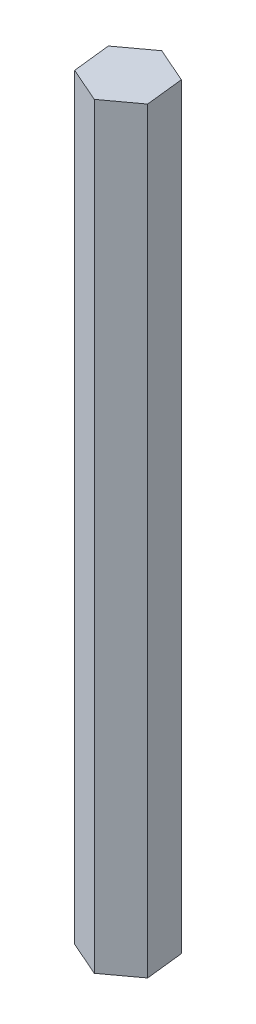
ISO-10303-21;
HEADER;
FILE_DESCRIPTION(('STEP AP214'),'2;1');
FILE_NAME('part.step','',(''),(''),'','','');
FILE_SCHEMA(('AUTOMOTIVE_DESIGN { 1 0 10303 214 1 1 1 1 }'));
ENDSEC;
DATA;
#1=APPLICATION_CONTEXT('core data for automotive mechanical design processes');
#2=APPLICATION_PROTOCOL_DEFINITION('international standard','automotive_design',2000,#1);
#3=PRODUCT_CONTEXT('',#1,'mechanical');
#4=PRODUCT('Part','Part','',(#3));
#5=PRODUCT_RELATED_PRODUCT_CATEGORY('part','',(#4));
#6=PRODUCT_DEFINITION_FORMATION('','',#4);
#7=PRODUCT_DEFINITION_CONTEXT('part definition',#1,'design');
#8=PRODUCT_DEFINITION('design','',#6,#7);
#9=PRODUCT_DEFINITION_SHAPE('','',#8);
#10=(LENGTH_UNIT() NAMED_UNIT(*) SI_UNIT(.MILLI.,.METRE.));
#11=(NAMED_UNIT(*) PLANE_ANGLE_UNIT() SI_UNIT($,.RADIAN.));
#12=(NAMED_UNIT(*) SI_UNIT($,.STERADIAN.) SOLID_ANGLE_UNIT());
#13=UNCERTAINTY_MEASURE_WITH_UNIT(LENGTH_MEASURE(1.E-05),#10,'distance_accuracy_value','');
#14=(GEOMETRIC_REPRESENTATION_CONTEXT(3) GLOBAL_UNCERTAINTY_ASSIGNED_CONTEXT((#13)) GLOBAL_UNIT_ASSIGNED_CONTEXT((#10,
#11,#12)) REPRESENTATION_CONTEXT('',''));
#15=CARTESIAN_POINT('',(0.,0.,0.));
#16=DIRECTION('',(0.,0.,1.));
#17=DIRECTION('',(1.,0.,0.));
#18=AXIS2_PLACEMENT_3D('',#15,#16,#17);
#19=CARTESIAN_POINT('',(0.812404027505649,-7.31682991666651,0.));
#20=DIRECTION('',(0.592515616364335,0.,0.805558963927776));
#21=DIRECTION('',(0.805558963927776,0.,-0.592515616364335));
#22=AXIS2_PLACEMENT_3D('',#19,#20,#21);
#23=PLANE('',#22);
#24=DIRECTION('',(0.,1.,0.));
#25=VECTOR('',#24,1.);
#26=CARTESIAN_POINT('',(6.742762596756,-7.31682991666651,-4.36197748428997));
#27=LINE('',#26,#25);
#28=CARTESIAN_POINT('',(6.74276259675599,138.683170083334,-4.36197748428997));
#29=VERTEX_POINT('',#28);
#30=CARTESIAN_POINT('',(6.742762596756,-7.31682991666651,-4.36197748428996));
#31=VERTEX_POINT('',#30);
#32=EDGE_CURVE('E19',#29,#31,#27,.F.);
#33=ORIENTED_EDGE('',*,*,#32,.F.);
#34=DIRECTION('',(0.805558963927776,0.,-0.592515616364335));
#35=VECTOR('',#34,1.);
#36=CARTESIAN_POINT('',(0.812404027505649,138.683170083334,0.));
#37=LINE('',#36,#35);
#38=CARTESIAN_POINT('',(0.812404027505652,138.683170083334,0.));
#39=VERTEX_POINT('',#38);
#40=EDGE_CURVE('E107',#39,#29,#37,.T.);
#41=ORIENTED_EDGE('',*,*,#40,.F.);
#42=DIRECTION('',(0.,1.,0.));
#43=VECTOR('',#42,1.);
#44=CARTESIAN_POINT('',(0.812404027505651,-7.31682991666651,0.));
#45=LINE('',#44,#43);
#46=CARTESIAN_POINT('',(0.812404027505654,-7.31682991666651,0.));
#47=VERTEX_POINT('',#46);
#48=EDGE_CURVE('E112',#47,#39,#45,.T.);
#49=ORIENTED_EDGE('',*,*,#48,.F.);
#50=DIRECTION('',(0.805558963927776,0.,-0.592515616364335));
#51=VECTOR('',#50,1.);
#52=CARTESIAN_POINT('',(0.812404027505649,-7.31682991666651,0.));
#53=LINE('',#52,#51);
#54=EDGE_CURVE('E90',#47,#31,#53,.T.);
#55=ORIENTED_EDGE('',*,*,#54,.T.);
#56=EDGE_LOOP('',(#33,#41,#49,#55));
#57=FACE_BOUND('',#56,.T.);
#58=ADVANCED_FACE('F16',(#57),#23,.T.);
#59=CARTESIAN_POINT('',(6.742762596756,-7.31682991666651,-4.36197748428994));
#60=DIRECTION('',(0.993892335189894,0.,-0.110354093946622));
#61=DIRECTION('',(-0.110354093946622,0.,-0.993892335189894));
#62=AXIS2_PLACEMENT_3D('',#59,#60,#61);
#63=PLANE('',#62);
#64=DIRECTION('',(0.,1.,0.));
#65=VECTOR('',#64,1.);
#66=CARTESIAN_POINT('',(5.9303585692503,-7.31682991666651,-11.6788074009564));
#67=LINE('',#66,#65);
#68=CARTESIAN_POINT('',(5.93035856925034,138.683170083334,-11.6788074009564));
#69=VERTEX_POINT('',#68);
#70=CARTESIAN_POINT('',(5.93035856925034,-7.31682991666651,-11.6788074009564));
#71=VERTEX_POINT('',#70);
#72=EDGE_CURVE('E72',#69,#71,#67,.F.);
#73=ORIENTED_EDGE('',*,*,#72,.F.);
#74=DIRECTION('',(-0.110354093946622,0.,-0.993892335189894));
#75=VECTOR('',#74,1.);
#76=CARTESIAN_POINT('',(6.742762596756,138.683170083334,-4.36197748428997));
#77=LINE('',#76,#75);
#78=EDGE_CURVE('E105',#29,#69,#77,.T.);
#79=ORIENTED_EDGE('',*,*,#78,.F.);
#80=ORIENTED_EDGE('',*,*,#32,.T.);
#81=DIRECTION('',(-0.110354093946623,0.,-0.993892335189894));
#82=VECTOR('',#81,1.);
#83=CARTESIAN_POINT('',(6.742762596756,-7.31682991666651,-4.36197748428994));
#84=LINE('',#83,#82);
#85=EDGE_CURVE('E69',#31,#71,#84,.T.);
#86=ORIENTED_EDGE('',*,*,#85,.T.);
#87=EDGE_LOOP('',(#73,#79,#80,#86));
#88=FACE_BOUND('',#87,.T.);
#89=ADVANCED_FACE('F71',(#88),#63,.T.);
#90=CARTESIAN_POINT('',(5.93035856925034,-7.31682991666651,-11.6788074009564));
#91=DIRECTION('',(0.401376718825558,0.,-0.915913057874397));
#92=DIRECTION('',(-0.915913057874397,0.,-0.401376718825558));
#93=AXIS2_PLACEMENT_3D('',#90,#91,#92);
#94=PLANE('',#93);
#95=DIRECTION('',(0.,1.,0.));
#96=VECTOR('',#95,1.);
#97=CARTESIAN_POINT('',(-0.812404027505653,-7.31682991666651,-14.633659833333));
#98=LINE('',#97,#96);
#99=CARTESIAN_POINT('',(-0.812404027505658,138.683170083334,-14.633659833333));
#100=VERTEX_POINT('',#99);
#101=CARTESIAN_POINT('',(-0.81240402750566,-7.31682991666651,-14.633659833333));
#102=VERTEX_POINT('',#101);
#103=EDGE_CURVE('E77',#100,#102,#98,.F.);
#104=ORIENTED_EDGE('',*,*,#103,.F.);
#105=DIRECTION('',(-0.9159130578744,0.,-0.40137671882555));
#106=VECTOR('',#105,1.);
#107=CARTESIAN_POINT('',(5.93035856925034,138.683170083334,-11.6788074009565));
#108=LINE('',#107,#106);
#109=EDGE_CURVE('E83',#69,#100,#108,.T.);
#110=ORIENTED_EDGE('',*,*,#109,.F.);
#111=ORIENTED_EDGE('',*,*,#72,.T.);
#112=DIRECTION('',(-0.915913057874395,0.,-0.401376718825562));
#113=VECTOR('',#112,1.);
#114=CARTESIAN_POINT('',(5.93035856925034,-7.31682991666651,-11.6788074009564));
#115=LINE('',#114,#113);
#116=EDGE_CURVE('E76',#71,#102,#115,.T.);
#117=ORIENTED_EDGE('',*,*,#116,.T.);
#118=EDGE_LOOP('',(#104,#110,#111,#117));
#119=FACE_BOUND('',#118,.T.);
#120=ADVANCED_FACE('F80',(#119),#94,.T.);
#121=CARTESIAN_POINT('',(-0.812404027505653,-7.31682991666651,-14.633659833333));
#122=DIRECTION('',(-0.592515616364336,0.,-0.805558963927775));
#123=DIRECTION('',(-0.805558963927775,0.,0.592515616364336));
#124=AXIS2_PLACEMENT_3D('',#121,#122,#123);
#125=PLANE('',#124);
#126=DIRECTION('',(0.,1.,0.));
#127=VECTOR('',#126,1.);
#128=CARTESIAN_POINT('',(-6.74276259675599,-7.31682991666651,-10.2716823490431));
#129=LINE('',#128,#127);
#130=CARTESIAN_POINT('',(-6.74276259675599,138.683170083334,-10.2716823490431));
#131=VERTEX_POINT('',#130);
#132=CARTESIAN_POINT('',(-6.74276259675598,-7.31682991666651,-10.2716823490431));
#133=VERTEX_POINT('',#132);
#134=EDGE_CURVE('E100',#131,#133,#129,.F.);
#135=ORIENTED_EDGE('',*,*,#134,.F.);
#136=DIRECTION('',(-0.805558963927778,0.,0.592515616364333));
#137=VECTOR('',#136,1.);
#138=CARTESIAN_POINT('',(-0.812404027505652,138.683170083334,-14.633659833333));
#139=LINE('',#138,#137);
#140=EDGE_CURVE('E98',#100,#131,#139,.T.);
#141=ORIENTED_EDGE('',*,*,#140,.F.);
#142=ORIENTED_EDGE('',*,*,#103,.T.);
#143=DIRECTION('',(-0.805558963927778,0.,0.592515616364333));
#144=VECTOR('',#143,1.);
#145=CARTESIAN_POINT('',(-0.812404027505653,-7.31682991666651,-14.633659833333));
#146=LINE('',#145,#144);
#147=EDGE_CURVE('E88',#102,#133,#146,.T.);
#148=ORIENTED_EDGE('',*,*,#147,.T.);
#149=EDGE_LOOP('',(#135,#141,#142,#148));
#150=FACE_BOUND('',#149,.T.);
#151=ADVANCED_FACE('F96',(#150),#125,.T.);
#152=CARTESIAN_POINT('',(0.,-7.31682991666651,-7.3168299166665));
#153=DIRECTION('',(0.,1.,0.));
#154=DIRECTION('',(0.,0.,1.));
#155=AXIS2_PLACEMENT_3D('',#152,#153,#154);
#156=PLANE('',#155);
#157=DIRECTION('',(0.915913057874397,0.,0.401376718825558));
#158=VECTOR('',#157,1.);
#159=CARTESIAN_POINT('',(-5.93035856925034,-7.31682991666651,-2.95485243237657));
#160=LINE('',#159,#158);
#161=CARTESIAN_POINT('',(-5.93035856925034,-7.31682991666651,-2.95485243237657));
#162=VERTEX_POINT('',#161);
#163=EDGE_CURVE('E114',#162,#47,#160,.T.);
#164=ORIENTED_EDGE('',*,*,#163,.F.);
#165=DIRECTION('',(0.110354093946621,0.,0.993892335189894));
#166=VECTOR('',#165,1.);
#167=CARTESIAN_POINT('',(-6.74276259675599,-7.31682991666651,-10.2716823490431));
#168=LINE('',#167,#166);
#169=EDGE_CURVE('E119',#133,#162,#168,.T.);
#170=ORIENTED_EDGE('',*,*,#169,.F.);
#171=ORIENTED_EDGE('',*,*,#147,.F.);
#172=ORIENTED_EDGE('',*,*,#116,.F.);
#173=ORIENTED_EDGE('',*,*,#85,.F.);
#174=ORIENTED_EDGE('',*,*,#54,.F.);
#175=EDGE_LOOP('',(#164,#170,#171,#172,#173,#174));
#176=FACE_BOUND('',#175,.T.);
#177=ADVANCED_FACE('F86',(#176),#156,.F.);
#178=CARTESIAN_POINT('',(-5.93035856925034,-7.31682991666651,-2.95485243237657));
#179=DIRECTION('',(-0.401376718825558,0.,0.915913057874397));
#180=DIRECTION('',(0.915913057874397,0.,0.401376718825558));
#181=AXIS2_PLACEMENT_3D('',#178,#179,#180);
#182=PLANE('',#181);
#183=ORIENTED_EDGE('',*,*,#48,.T.);
#184=DIRECTION('',(0.915913057874397,0.,0.401376718825558));
#185=VECTOR('',#184,1.);
#186=CARTESIAN_POINT('',(-5.93035856925034,138.683170083334,-2.9548524323766));
#187=LINE('',#186,#185);
#188=CARTESIAN_POINT('',(-5.93035856925034,138.683170083334,-2.95485243237659));
#189=VERTEX_POINT('',#188);
#190=EDGE_CURVE('E34',#189,#39,#187,.T.);
#191=ORIENTED_EDGE('',*,*,#190,.F.);
#192=DIRECTION('',(0.,1.,0.));
#193=VECTOR('',#192,1.);
#194=CARTESIAN_POINT('',(-5.93035856925034,-7.31682991666651,-2.95485243237657));
#195=LINE('',#194,#193);
#196=EDGE_CURVE('E25',#162,#189,#195,.T.);
#197=ORIENTED_EDGE('',*,*,#196,.F.);
#198=ORIENTED_EDGE('',*,*,#163,.T.);
#199=EDGE_LOOP('',(#183,#191,#197,#198));
#200=FACE_BOUND('',#199,.T.);
#201=ADVANCED_FACE('F121',(#200),#182,.T.);
#202=CARTESIAN_POINT('',(0.,138.683170083334,-7.31682991666654));
#203=DIRECTION('',(0.,1.,0.));
#204=DIRECTION('',(0.,0.,1.));
#205=AXIS2_PLACEMENT_3D('',#202,#203,#204);
#206=PLANE('',#205);
#207=DIRECTION('',(0.110354093946621,0.,0.993892335189894));
#208=VECTOR('',#207,1.);
#209=CARTESIAN_POINT('',(-6.74276259675599,138.683170083334,-10.2716823490431));
#210=LINE('',#209,#208);
#211=EDGE_CURVE('E11',#189,#131,#210,.F.);
#212=ORIENTED_EDGE('',*,*,#211,.F.);
#213=ORIENTED_EDGE('',*,*,#190,.T.);
#214=ORIENTED_EDGE('',*,*,#40,.T.);
#215=ORIENTED_EDGE('',*,*,#78,.T.);
#216=ORIENTED_EDGE('',*,*,#109,.T.);
#217=ORIENTED_EDGE('',*,*,#140,.T.);
#218=EDGE_LOOP('',(#212,#213,#214,#215,#216,#217));
#219=FACE_BOUND('',#218,.T.);
#220=ADVANCED_FACE('F103',(#219),#206,.T.);
#221=CARTESIAN_POINT('',(-6.74276259675599,-7.31682991666651,-10.2716823490431));
#222=DIRECTION('',(-0.993892335189894,0.,0.110354093946621));
#223=DIRECTION('',(0.110354093946621,0.,0.993892335189894));
#224=AXIS2_PLACEMENT_3D('',#221,#222,#223);
#225=PLANE('',#224);
#226=ORIENTED_EDGE('',*,*,#196,.T.);
#227=ORIENTED_EDGE('',*,*,#211,.T.);
#228=ORIENTED_EDGE('',*,*,#134,.T.);
#229=ORIENTED_EDGE('',*,*,#169,.T.);
#230=EDGE_LOOP('',(#226,#227,#228,#229));
#231=FACE_BOUND('',#230,.T.);
#232=ADVANCED_FACE('F124',(#231),#225,.T.);
#233=CLOSED_SHELL('',(#58,#89,#120,#151,#177,#201,#220,#232));
#234=MANIFOLD_SOLID_BREP('B1',#233);
#235=ADVANCED_BREP_SHAPE_REPRESENTATION('',(#18,#234),#14);
#236=SHAPE_DEFINITION_REPRESENTATION(#9,#235);
ENDSEC;
END-ISO-10303-21;
